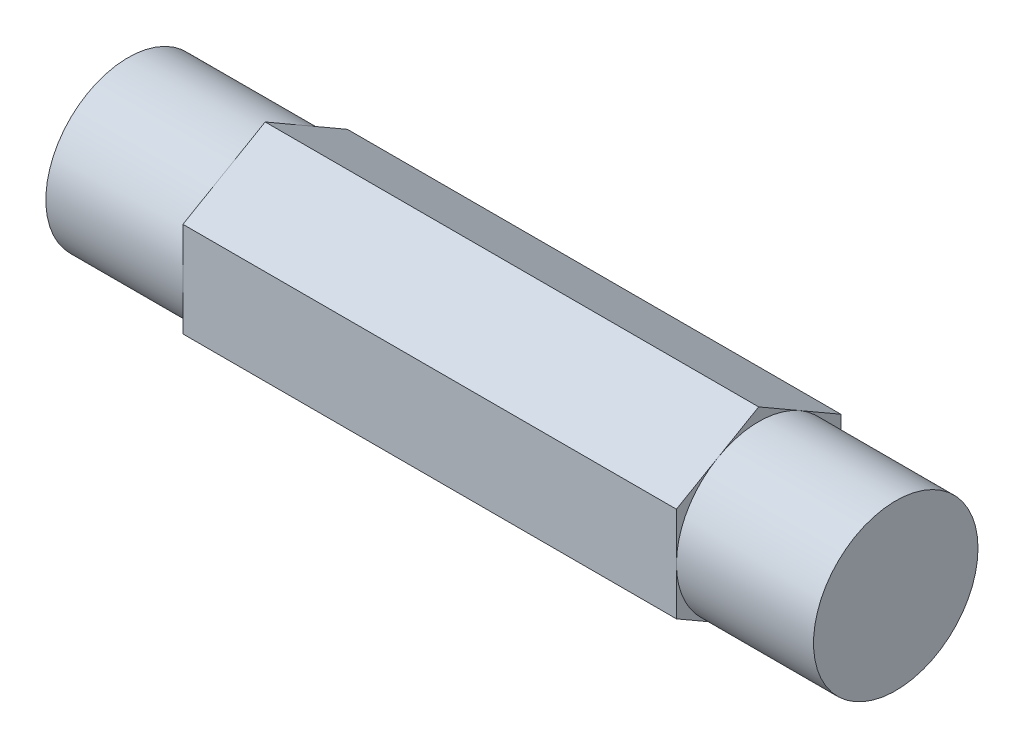
ISO-10303-21;
HEADER;
FILE_DESCRIPTION(('STEP AP214'),'2;1');
FILE_NAME('part.step','',(''),(''),'','','');
FILE_SCHEMA(('AUTOMOTIVE_DESIGN { 1 0 10303 214 1 1 1 1 }'));
ENDSEC;
DATA;
#1=APPLICATION_CONTEXT('core data for automotive mechanical design processes');
#2=APPLICATION_PROTOCOL_DEFINITION('international standard','automotive_design',2000,#1);
#3=PRODUCT_CONTEXT('',#1,'mechanical');
#4=PRODUCT('Part','Part','',(#3));
#5=PRODUCT_RELATED_PRODUCT_CATEGORY('part','',(#4));
#6=PRODUCT_DEFINITION_FORMATION('','',#4);
#7=PRODUCT_DEFINITION_CONTEXT('part definition',#1,'design');
#8=PRODUCT_DEFINITION('design','',#6,#7);
#9=PRODUCT_DEFINITION_SHAPE('','',#8);
#10=(LENGTH_UNIT() NAMED_UNIT(*) SI_UNIT(.MILLI.,.METRE.));
#11=(NAMED_UNIT(*) PLANE_ANGLE_UNIT() SI_UNIT($,.RADIAN.));
#12=(NAMED_UNIT(*) SI_UNIT($,.STERADIAN.) SOLID_ANGLE_UNIT());
#13=UNCERTAINTY_MEASURE_WITH_UNIT(LENGTH_MEASURE(1.E-05),#10,'distance_accuracy_value','');
#14=(GEOMETRIC_REPRESENTATION_CONTEXT(3) GLOBAL_UNCERTAINTY_ASSIGNED_CONTEXT((#13)) GLOBAL_UNIT_ASSIGNED_CONTEXT((#10,
#11,#12)) REPRESENTATION_CONTEXT('',''));
#15=CARTESIAN_POINT('',(0.,0.,0.));
#16=DIRECTION('',(0.,0.,1.));
#17=DIRECTION('',(1.,0.,0.));
#18=AXIS2_PLACEMENT_3D('',#15,#16,#17);
#19=CARTESIAN_POINT('',(44.45,2.74963065701559,-4.7625));
#20=DIRECTION('',(0.,-0.866025403784438,0.5));
#21=DIRECTION('',(0.,-0.5,-0.866025403784439));
#22=AXIS2_PLACEMENT_3D('',#19,#20,#21);
#23=PLANE('',#22);
#24=DIRECTION('',(0.,0.5,0.866025403784439));
#25=VECTOR('',#24,1.);
#26=CARTESIAN_POINT('',(36.5125,2.74963065701559,-4.7625));
#27=LINE('',#26,#25);
#28=CARTESIAN_POINT('',(36.5125,2.7496306570156,-4.7625));
#29=VERTEX_POINT('',#28);
#30=CARTESIAN_POINT('',(36.5125,4.12444598552339,-2.38125));
#31=VERTEX_POINT('',#30);
#32=EDGE_CURVE('E120',#29,#31,#27,.T.);
#33=ORIENTED_EDGE('',*,*,#32,.F.);
#34=DIRECTION('',(-1.,0.,0.));
#35=VECTOR('',#34,1.);
#36=CARTESIAN_POINT('',(44.45,2.74963065701559,-4.7625));
#37=LINE('',#36,#35);
#38=CARTESIAN_POINT('',(7.9375,2.7496306570156,-4.7625));
#39=VERTEX_POINT('',#38);
#40=EDGE_CURVE('E176',#29,#39,#37,.T.);
#41=ORIENTED_EDGE('',*,*,#40,.T.);
#42=DIRECTION('',(0.,-0.5,-0.866025403784439));
#43=VECTOR('',#42,1.);
#44=CARTESIAN_POINT('',(7.9375,2.74963065701559,-4.7625));
#45=LINE('',#44,#43);
#46=CARTESIAN_POINT('',(7.9375,4.12444598552339,-2.38125));
#47=VERTEX_POINT('',#46);
#48=EDGE_CURVE('E160',#47,#39,#45,.T.);
#49=ORIENTED_EDGE('',*,*,#48,.F.);
#50=CARTESIAN_POINT('',(7.9375,5.49926131403119,0.));
#51=VERTEX_POINT('',#50);
#52=EDGE_CURVE('E164',#51,#47,#45,.T.);
#53=ORIENTED_EDGE('',*,*,#52,.F.);
#54=DIRECTION('',(-1.,0.,0.));
#55=VECTOR('',#54,1.);
#56=CARTESIAN_POINT('',(44.45,5.49926131403119,0.));
#57=LINE('',#56,#55);
#58=CARTESIAN_POINT('',(36.5125,5.49926131403119,0.));
#59=VERTEX_POINT('',#58);
#60=EDGE_CURVE('E149',#59,#51,#57,.T.);
#61=ORIENTED_EDGE('',*,*,#60,.F.);
#62=EDGE_CURVE('E128',#31,#59,#27,.T.);
#63=ORIENTED_EDGE('',*,*,#62,.F.);
#64=EDGE_LOOP('',(#33,#41,#49,#53,#61,#63));
#65=FACE_BOUND('',#64,.T.);
#66=ADVANCED_FACE('F32',(#65),#23,.F.);
#67=CARTESIAN_POINT('',(44.45,5.49926131403119,0.));
#68=DIRECTION('',(0.,-0.866025403784439,-0.5));
#69=DIRECTION('',(0.,0.5,-0.866025403784439));
#70=AXIS2_PLACEMENT_3D('',#67,#68,#69);
#71=PLANE('',#70);
#72=DIRECTION('',(0.,-0.5,0.866025403784439));
#73=VECTOR('',#72,1.);
#74=CARTESIAN_POINT('',(36.5125,5.49926131403119,0.));
#75=LINE('',#74,#73);
#76=CARTESIAN_POINT('',(36.5125,4.12444598552339,2.38125));
#77=VERTEX_POINT('',#76);
#78=EDGE_CURVE('E135',#59,#77,#75,.T.);
#79=ORIENTED_EDGE('',*,*,#78,.F.);
#80=ORIENTED_EDGE('',*,*,#60,.T.);
#81=DIRECTION('',(0.,0.5,-0.866025403784439));
#82=VECTOR('',#81,1.);
#83=CARTESIAN_POINT('',(7.9375,5.49926131403119,0.));
#84=LINE('',#83,#82);
#85=CARTESIAN_POINT('',(7.9375,4.12444598552339,2.38125));
#86=VERTEX_POINT('',#85);
#87=EDGE_CURVE('E167',#86,#51,#84,.T.);
#88=ORIENTED_EDGE('',*,*,#87,.F.);
#89=CARTESIAN_POINT('',(7.9375,2.7496306570156,4.7625));
#90=VERTEX_POINT('',#89);
#91=EDGE_CURVE('E171',#90,#86,#84,.T.);
#92=ORIENTED_EDGE('',*,*,#91,.F.);
#93=DIRECTION('',(-1.,0.,0.));
#94=VECTOR('',#93,1.);
#95=CARTESIAN_POINT('',(44.45,2.7496306570156,4.7625));
#96=LINE('',#95,#94);
#97=CARTESIAN_POINT('',(36.5125,2.7496306570156,4.7625));
#98=VERTEX_POINT('',#97);
#99=EDGE_CURVE('E184',#98,#90,#96,.T.);
#100=ORIENTED_EDGE('',*,*,#99,.F.);
#101=EDGE_CURVE('E150',#77,#98,#75,.T.);
#102=ORIENTED_EDGE('',*,*,#101,.F.);
#103=EDGE_LOOP('',(#79,#80,#88,#92,#100,#102));
#104=FACE_BOUND('',#103,.T.);
#105=ADVANCED_FACE('F265',(#104),#71,.F.);
#106=CARTESIAN_POINT('',(44.45,2.7496306570156,4.7625));
#107=DIRECTION('',(0.,0.,-1.));
#108=DIRECTION('',(0.,1.,0.));
#109=AXIS2_PLACEMENT_3D('',#106,#107,#108);
#110=PLANE('',#109);
#111=DIRECTION('',(0.,-1.,0.));
#112=VECTOR('',#111,1.);
#113=CARTESIAN_POINT('',(36.5125,2.7496306570156,4.7625));
#114=LINE('',#113,#112);
#115=CARTESIAN_POINT('',(36.5125,0.,4.7625));
#116=VERTEX_POINT('',#115);
#117=EDGE_CURVE('E233',#98,#116,#114,.T.);
#118=ORIENTED_EDGE('',*,*,#117,.F.);
#119=ORIENTED_EDGE('',*,*,#99,.T.);
#120=DIRECTION('',(0.,1.,0.));
#121=VECTOR('',#120,1.);
#122=CARTESIAN_POINT('',(7.9375,2.7496306570156,4.7625));
#123=LINE('',#122,#121);
#124=CARTESIAN_POINT('',(7.9375,0.,4.7625));
#125=VERTEX_POINT('',#124);
#126=EDGE_CURVE('E172',#125,#90,#123,.T.);
#127=ORIENTED_EDGE('',*,*,#126,.F.);
#128=CARTESIAN_POINT('',(7.9375,-2.7496306570156,4.7625));
#129=VERTEX_POINT('',#128);
#130=EDGE_CURVE('E175',#129,#125,#123,.T.);
#131=ORIENTED_EDGE('',*,*,#130,.F.);
#132=DIRECTION('',(-1.,0.,0.));
#133=VECTOR('',#132,1.);
#134=CARTESIAN_POINT('',(44.45,-2.74963065701559,4.7625));
#135=LINE('',#134,#133);
#136=CARTESIAN_POINT('',(36.5125,-2.7496306570156,4.7625));
#137=VERTEX_POINT('',#136);
#138=EDGE_CURVE('E182',#137,#129,#135,.T.);
#139=ORIENTED_EDGE('',*,*,#138,.F.);
#140=EDGE_CURVE('E232',#116,#137,#114,.T.);
#141=ORIENTED_EDGE('',*,*,#140,.F.);
#142=EDGE_LOOP('',(#118,#119,#127,#131,#139,#141));
#143=FACE_BOUND('',#142,.T.);
#144=ADVANCED_FACE('F271',(#143),#110,.F.);
#145=CARTESIAN_POINT('',(44.45,-2.74963065701559,4.7625));
#146=DIRECTION('',(0.,0.866025403784439,-0.5));
#147=DIRECTION('',(0.,0.5,0.866025403784439));
#148=AXIS2_PLACEMENT_3D('',#145,#146,#147);
#149=PLANE('',#148);
#150=DIRECTION('',(0.,-0.5,-0.866025403784439));
#151=VECTOR('',#150,1.);
#152=CARTESIAN_POINT('',(36.5125,-2.74963065701559,4.7625));
#153=LINE('',#152,#151);
#154=CARTESIAN_POINT('',(36.5125,-4.12444598552339,2.38125));
#155=VERTEX_POINT('',#154);
#156=EDGE_CURVE('E231',#137,#155,#153,.T.);
#157=ORIENTED_EDGE('',*,*,#156,.F.);
#158=ORIENTED_EDGE('',*,*,#138,.T.);
#159=DIRECTION('',(0.,0.5,0.866025403784439));
#160=VECTOR('',#159,1.);
#161=CARTESIAN_POINT('',(7.9375,-2.74963065701559,4.7625));
#162=LINE('',#161,#160);
#163=CARTESIAN_POINT('',(7.9375,-4.12444598552339,2.38125));
#164=VERTEX_POINT('',#163);
#165=EDGE_CURVE('E168',#164,#129,#162,.T.);
#166=ORIENTED_EDGE('',*,*,#165,.F.);
#167=CARTESIAN_POINT('',(7.9375,-5.49926131403119,0.));
#168=VERTEX_POINT('',#167);
#169=EDGE_CURVE('E165',#168,#164,#162,.T.);
#170=ORIENTED_EDGE('',*,*,#169,.F.);
#171=DIRECTION('',(-1.,0.,0.));
#172=VECTOR('',#171,1.);
#173=CARTESIAN_POINT('',(44.45,-5.49926131403119,0.));
#174=LINE('',#173,#172);
#175=CARTESIAN_POINT('',(36.5125,-5.49926131403119,0.));
#176=VERTEX_POINT('',#175);
#177=EDGE_CURVE('E180',#176,#168,#174,.T.);
#178=ORIENTED_EDGE('',*,*,#177,.F.);
#179=EDGE_CURVE('E229',#155,#176,#153,.T.);
#180=ORIENTED_EDGE('',*,*,#179,.F.);
#181=EDGE_LOOP('',(#157,#158,#166,#170,#178,#180));
#182=FACE_BOUND('',#181,.T.);
#183=ADVANCED_FACE('F248',(#182),#149,.F.);
#184=CARTESIAN_POINT('',(44.45,-5.49926131403119,0.));
#185=DIRECTION('',(0.,0.866025403784439,0.5));
#186=DIRECTION('',(0.,-0.5,0.866025403784439));
#187=AXIS2_PLACEMENT_3D('',#184,#185,#186);
#188=PLANE('',#187);
#189=DIRECTION('',(0.,0.5,-0.866025403784439));
#190=VECTOR('',#189,1.);
#191=CARTESIAN_POINT('',(36.5125,-5.49926131403119,0.));
#192=LINE('',#191,#190);
#193=CARTESIAN_POINT('',(36.5125,-4.12444598552339,-2.38125));
#194=VERTEX_POINT('',#193);
#195=EDGE_CURVE('E227',#176,#194,#192,.T.);
#196=ORIENTED_EDGE('',*,*,#195,.F.);
#197=ORIENTED_EDGE('',*,*,#177,.T.);
#198=DIRECTION('',(0.,-0.5,0.866025403784439));
#199=VECTOR('',#198,1.);
#200=CARTESIAN_POINT('',(7.9375,-5.49926131403119,0.));
#201=LINE('',#200,#199);
#202=CARTESIAN_POINT('',(7.9375,-4.12444598552339,-2.38125));
#203=VERTEX_POINT('',#202);
#204=EDGE_CURVE('E161',#203,#168,#201,.T.);
#205=ORIENTED_EDGE('',*,*,#204,.F.);
#206=CARTESIAN_POINT('',(7.9375,-2.7496306570156,-4.7625));
#207=VERTEX_POINT('',#206);
#208=EDGE_CURVE('E157',#207,#203,#201,.T.);
#209=ORIENTED_EDGE('',*,*,#208,.F.);
#210=DIRECTION('',(-1.,0.,0.));
#211=VECTOR('',#210,1.);
#212=CARTESIAN_POINT('',(44.45,-2.74963065701559,-4.7625));
#213=LINE('',#212,#211);
#214=CARTESIAN_POINT('',(36.5125,-2.7496306570156,-4.7625));
#215=VERTEX_POINT('',#214);
#216=EDGE_CURVE('E178',#215,#207,#213,.T.);
#217=ORIENTED_EDGE('',*,*,#216,.F.);
#218=EDGE_CURVE('E146',#194,#215,#192,.T.);
#219=ORIENTED_EDGE('',*,*,#218,.F.);
#220=EDGE_LOOP('',(#196,#197,#205,#209,#217,#219));
#221=FACE_BOUND('',#220,.T.);
#222=ADVANCED_FACE('F215',(#221),#188,.F.);
#223=CARTESIAN_POINT('',(44.45,-2.74963065701559,-4.7625));
#224=DIRECTION('',(0.,0.,1.));
#225=DIRECTION('',(1.,0.,0.));
#226=AXIS2_PLACEMENT_3D('',#223,#224,#225);
#227=PLANE('',#226);
#228=DIRECTION('',(0.,1.,0.));
#229=VECTOR('',#228,1.);
#230=CARTESIAN_POINT('',(36.5125,-2.74963065701559,-4.7625));
#231=LINE('',#230,#229);
#232=CARTESIAN_POINT('',(36.5125,0.,-4.7625));
#233=VERTEX_POINT('',#232);
#234=EDGE_CURVE('E11',#215,#233,#231,.T.);
#235=ORIENTED_EDGE('',*,*,#234,.F.);
#236=ORIENTED_EDGE('',*,*,#216,.T.);
#237=DIRECTION('',(0.,-1.,0.));
#238=VECTOR('',#237,1.);
#239=CARTESIAN_POINT('',(7.9375,-2.74963065701559,-4.7625));
#240=LINE('',#239,#238);
#241=CARTESIAN_POINT('',(7.9375,0.,-4.7625));
#242=VERTEX_POINT('',#241);
#243=EDGE_CURVE('E190',#242,#207,#240,.T.);
#244=ORIENTED_EDGE('',*,*,#243,.F.);
#245=EDGE_CURVE('E192',#39,#242,#240,.T.);
#246=ORIENTED_EDGE('',*,*,#245,.F.);
#247=ORIENTED_EDGE('',*,*,#40,.F.);
#248=EDGE_CURVE('E35',#233,#29,#231,.T.);
#249=ORIENTED_EDGE('',*,*,#248,.F.);
#250=EDGE_LOOP('',(#235,#236,#244,#246,#247,#249));
#251=FACE_BOUND('',#250,.T.);
#252=ADVANCED_FACE('F205',(#251),#227,.F.);
#253=CARTESIAN_POINT('',(7.9375,0.,0.));
#254=DIRECTION('',(-1.,0.,0.));
#255=DIRECTION('',(0.,0.,1.));
#256=AXIS2_PLACEMENT_3D('',#253,#254,#255);
#257=PLANE('',#256);
#258=ORIENTED_EDGE('',*,*,#130,.T.);
#259=CARTESIAN_POINT('',(7.9375,0.,0.));
#260=DIRECTION('',(-1.,0.,0.));
#261=DIRECTION('',(0.,0.,1.));
#262=AXIS2_PLACEMENT_3D('',#259,#260,#261);
#263=CIRCLE('',#262,4.7625);
#264=EDGE_CURVE('E127',#164,#125,#263,.T.);
#265=ORIENTED_EDGE('',*,*,#264,.F.);
#266=ORIENTED_EDGE('',*,*,#165,.T.);
#267=EDGE_LOOP('',(#258,#265,#266));
#268=FACE_BOUND('',#267,.T.);
#269=ADVANCED_FACE('F257',(#268),#257,.T.);
#270=ORIENTED_EDGE('',*,*,#126,.T.);
#271=ORIENTED_EDGE('',*,*,#91,.T.);
#272=EDGE_CURVE('E154',#125,#86,#263,.T.);
#273=ORIENTED_EDGE('',*,*,#272,.F.);
#274=EDGE_LOOP('',(#270,#271,#273));
#275=FACE_BOUND('',#274,.T.);
#276=ADVANCED_FACE('F272',(#275),#257,.T.);
#277=ORIENTED_EDGE('',*,*,#87,.T.);
#278=ORIENTED_EDGE('',*,*,#52,.T.);
#279=EDGE_CURVE('E158',#86,#47,#263,.T.);
#280=ORIENTED_EDGE('',*,*,#279,.F.);
#281=EDGE_LOOP('',(#277,#278,#280));
#282=FACE_BOUND('',#281,.T.);
#283=ADVANCED_FACE('F223',(#282),#257,.T.);
#284=ORIENTED_EDGE('',*,*,#169,.T.);
#285=EDGE_CURVE('E254',#203,#164,#263,.T.);
#286=ORIENTED_EDGE('',*,*,#285,.F.);
#287=ORIENTED_EDGE('',*,*,#204,.T.);
#288=EDGE_LOOP('',(#284,#286,#287));
#289=FACE_BOUND('',#288,.T.);
#290=ADVANCED_FACE('F252',(#289),#257,.T.);
#291=ORIENTED_EDGE('',*,*,#48,.T.);
#292=ORIENTED_EDGE('',*,*,#245,.T.);
#293=EDGE_CURVE('E54',#47,#242,#263,.T.);
#294=ORIENTED_EDGE('',*,*,#293,.F.);
#295=EDGE_LOOP('',(#291,#292,#294));
#296=FACE_BOUND('',#295,.T.);
#297=ADVANCED_FACE('F201',(#296),#257,.T.);
#298=ORIENTED_EDGE('',*,*,#208,.T.);
#299=EDGE_CURVE('E211',#242,#203,#263,.T.);
#300=ORIENTED_EDGE('',*,*,#299,.F.);
#301=ORIENTED_EDGE('',*,*,#243,.T.);
#302=EDGE_LOOP('',(#298,#300,#301));
#303=FACE_BOUND('',#302,.T.);
#304=ADVANCED_FACE('F209',(#303),#257,.T.);
#305=CARTESIAN_POINT('',(7.9375,0.,0.));
#306=DIRECTION('',(-1.,0.,0.));
#307=DIRECTION('',(0.,0.,1.));
#308=AXIS2_PLACEMENT_3D('',#305,#306,#307);
#309=CYLINDRICAL_SURFACE('',#308,4.7625);
#310=CARTESIAN_POINT('',(0.,0.,0.));
#311=DIRECTION('',(1.,0.,0.));
#312=DIRECTION('',(0.,0.,-1.));
#313=AXIS2_PLACEMENT_3D('',#310,#311,#312);
#314=CIRCLE('',#313,4.7625);
#315=CARTESIAN_POINT('',(0.,0.,-4.7625));
#316=VERTEX_POINT('',#315);
#317=EDGE_CURVE('E187',#316,#316,#314,.T.);
#318=ORIENTED_EDGE('',*,*,#317,.T.);
#319=EDGE_LOOP('',(#318));
#320=FACE_BOUND('',#319,.T.);
#321=ORIENTED_EDGE('',*,*,#279,.T.);
#322=ORIENTED_EDGE('',*,*,#293,.T.);
#323=ORIENTED_EDGE('',*,*,#299,.T.);
#324=ORIENTED_EDGE('',*,*,#285,.T.);
#325=ORIENTED_EDGE('',*,*,#264,.T.);
#326=ORIENTED_EDGE('',*,*,#272,.T.);
#327=EDGE_LOOP('',(#321,#322,#323,#324,#325,#326));
#328=FACE_BOUND('',#327,.T.);
#329=ADVANCED_FACE('F260',(#320,#328),#309,.T.);
#330=CARTESIAN_POINT('',(0.,0.,0.));
#331=DIRECTION('',(1.,0.,0.));
#332=DIRECTION('',(0.,0.,-1.));
#333=AXIS2_PLACEMENT_3D('',#330,#331,#332);
#334=PLANE('',#333);
#335=ORIENTED_EDGE('',*,*,#317,.F.);
#336=EDGE_LOOP('',(#335));
#337=FACE_BOUND('',#336,.T.);
#338=ADVANCED_FACE('F296',(#337),#334,.F.);
#339=CARTESIAN_POINT('',(36.5125,0.,0.));
#340=DIRECTION('',(1.,0.,0.));
#341=DIRECTION('',(0.,0.,-1.));
#342=AXIS2_PLACEMENT_3D('',#339,#340,#341);
#343=PLANE('',#342);
#344=ORIENTED_EDGE('',*,*,#32,.T.);
#345=CARTESIAN_POINT('',(36.5125,0.,0.));
#346=DIRECTION('',(1.,0.,0.));
#347=DIRECTION('',(0.,0.,-1.));
#348=AXIS2_PLACEMENT_3D('',#345,#346,#347);
#349=CIRCLE('',#348,4.7625);
#350=EDGE_CURVE('E46',#233,#31,#349,.T.);
#351=ORIENTED_EDGE('',*,*,#350,.F.);
#352=ORIENTED_EDGE('',*,*,#248,.T.);
#353=EDGE_LOOP('',(#344,#351,#352));
#354=FACE_BOUND('',#353,.T.);
#355=ADVANCED_FACE('F122',(#354),#343,.T.);
#356=ORIENTED_EDGE('',*,*,#62,.T.);
#357=ORIENTED_EDGE('',*,*,#78,.T.);
#358=EDGE_CURVE('E132',#31,#77,#349,.T.);
#359=ORIENTED_EDGE('',*,*,#358,.F.);
#360=EDGE_LOOP('',(#356,#357,#359));
#361=FACE_BOUND('',#360,.T.);
#362=ADVANCED_FACE('F133',(#361),#343,.T.);
#363=ORIENTED_EDGE('',*,*,#101,.T.);
#364=ORIENTED_EDGE('',*,*,#117,.T.);
#365=EDGE_CURVE('E140',#77,#116,#349,.T.);
#366=ORIENTED_EDGE('',*,*,#365,.F.);
#367=EDGE_LOOP('',(#363,#364,#366));
#368=FACE_BOUND('',#367,.T.);
#369=ADVANCED_FACE('F269',(#368),#343,.T.);
#370=ORIENTED_EDGE('',*,*,#140,.T.);
#371=ORIENTED_EDGE('',*,*,#156,.T.);
#372=EDGE_CURVE('E241',#116,#155,#349,.T.);
#373=ORIENTED_EDGE('',*,*,#372,.F.);
#374=EDGE_LOOP('',(#370,#371,#373));
#375=FACE_BOUND('',#374,.T.);
#376=ADVANCED_FACE('F239',(#375),#343,.T.);
#377=ORIENTED_EDGE('',*,*,#179,.T.);
#378=ORIENTED_EDGE('',*,*,#195,.T.);
#379=EDGE_CURVE('E246',#155,#194,#349,.T.);
#380=ORIENTED_EDGE('',*,*,#379,.F.);
#381=EDGE_LOOP('',(#377,#378,#380));
#382=FACE_BOUND('',#381,.T.);
#383=ADVANCED_FACE('F247',(#382),#343,.T.);
#384=ORIENTED_EDGE('',*,*,#218,.T.);
#385=ORIENTED_EDGE('',*,*,#234,.T.);
#386=EDGE_CURVE('E145',#194,#233,#349,.T.);
#387=ORIENTED_EDGE('',*,*,#386,.F.);
#388=EDGE_LOOP('',(#384,#385,#387));
#389=FACE_BOUND('',#388,.T.);
#390=ADVANCED_FACE('F226',(#389),#343,.T.);
#391=CARTESIAN_POINT('',(36.5125,0.,0.));
#392=DIRECTION('',(1.,0.,0.));
#393=DIRECTION('',(0.,0.,-1.));
#394=AXIS2_PLACEMENT_3D('',#391,#392,#393);
#395=CYLINDRICAL_SURFACE('',#394,4.7625);
#396=CARTESIAN_POINT('',(44.45,0.,0.));
#397=DIRECTION('',(1.,0.,0.));
#398=DIRECTION('',(0.,0.,-1.));
#399=AXIS2_PLACEMENT_3D('',#396,#397,#398);
#400=CIRCLE('',#399,4.7625);
#401=CARTESIAN_POINT('',(44.45,0.,-4.7625));
#402=VERTEX_POINT('',#401);
#403=EDGE_CURVE('E193',#402,#402,#400,.T.);
#404=ORIENTED_EDGE('',*,*,#403,.F.);
#405=EDGE_LOOP('',(#404));
#406=FACE_BOUND('',#405,.T.);
#407=ORIENTED_EDGE('',*,*,#350,.T.);
#408=ORIENTED_EDGE('',*,*,#358,.T.);
#409=ORIENTED_EDGE('',*,*,#365,.T.);
#410=ORIENTED_EDGE('',*,*,#372,.T.);
#411=ORIENTED_EDGE('',*,*,#379,.T.);
#412=ORIENTED_EDGE('',*,*,#386,.T.);
#413=EDGE_LOOP('',(#407,#408,#409,#410,#411,#412));
#414=FACE_BOUND('',#413,.T.);
#415=ADVANCED_FACE('F142',(#406,#414),#395,.T.);
#416=CARTESIAN_POINT('',(44.45,0.,0.));
#417=DIRECTION('',(1.,0.,0.));
#418=DIRECTION('',(0.,0.,-1.));
#419=AXIS2_PLACEMENT_3D('',#416,#417,#418);
#420=PLANE('',#419);
#421=ORIENTED_EDGE('',*,*,#403,.T.);
#422=EDGE_LOOP('',(#421));
#423=FACE_BOUND('',#422,.T.);
#424=ADVANCED_FACE('F299',(#423),#420,.T.);
#425=CLOSED_SHELL('',(#66,#105,#144,#183,#222,#252,#269,#276,#283,#290,#297,#304,#329,#338,#355,
#362,#369,#376,#383,#390,#415,#424));
#426=MANIFOLD_SOLID_BREP('B2',#425);
#427=ADVANCED_BREP_SHAPE_REPRESENTATION('',(#18,#426),#14);
#428=SHAPE_DEFINITION_REPRESENTATION(#9,#427);
ENDSEC;
END-ISO-10303-21;
